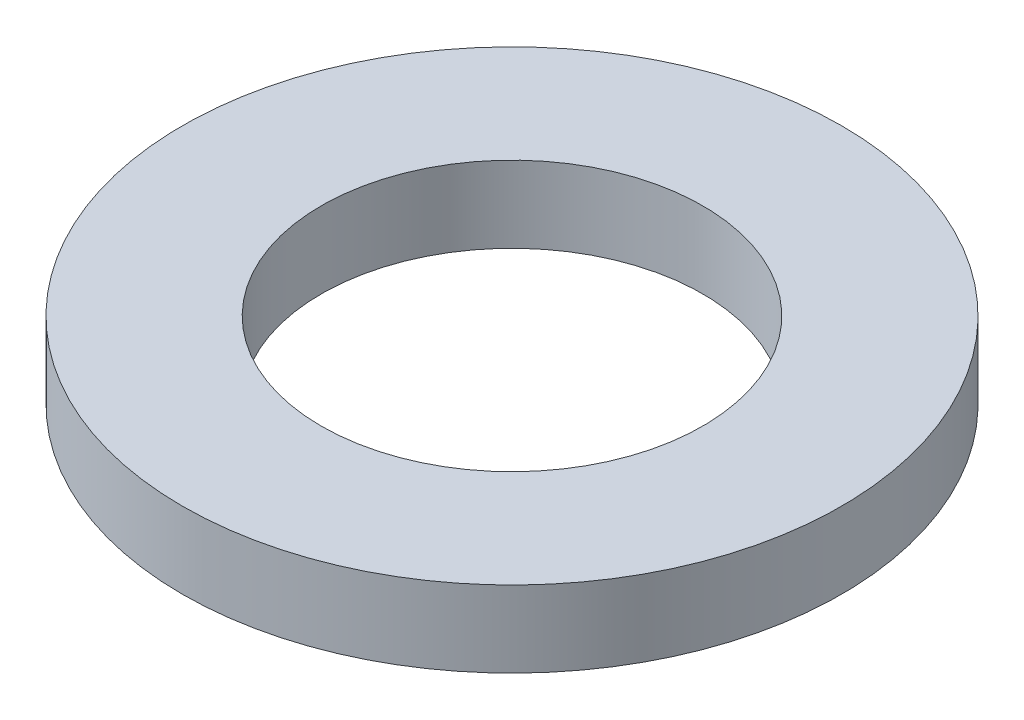
ISO-10303-21;
HEADER;
FILE_DESCRIPTION(('STEP AP214'),'2;1');
FILE_NAME('part.step','',(''),(''),'','','');
FILE_SCHEMA(('AUTOMOTIVE_DESIGN { 1 0 10303 214 1 1 1 1 }'));
ENDSEC;
DATA;
#1=APPLICATION_CONTEXT('core data for automotive mechanical design processes');
#2=APPLICATION_PROTOCOL_DEFINITION('international standard','automotive_design',2000,#1);
#3=PRODUCT_CONTEXT('',#1,'mechanical');
#4=PRODUCT('Part','Part','',(#3));
#5=PRODUCT_RELATED_PRODUCT_CATEGORY('part','',(#4));
#6=PRODUCT_DEFINITION_FORMATION('','',#4);
#7=PRODUCT_DEFINITION_CONTEXT('part definition',#1,'design');
#8=PRODUCT_DEFINITION('design','',#6,#7);
#9=PRODUCT_DEFINITION_SHAPE('','',#8);
#10=(LENGTH_UNIT() NAMED_UNIT(*) SI_UNIT(.MILLI.,.METRE.));
#11=(NAMED_UNIT(*) PLANE_ANGLE_UNIT() SI_UNIT($,.RADIAN.));
#12=(NAMED_UNIT(*) SI_UNIT($,.STERADIAN.) SOLID_ANGLE_UNIT());
#13=UNCERTAINTY_MEASURE_WITH_UNIT(LENGTH_MEASURE(1.E-05),#10,'distance_accuracy_value','');
#14=(GEOMETRIC_REPRESENTATION_CONTEXT(3) GLOBAL_UNCERTAINTY_ASSIGNED_CONTEXT((#13)) GLOBAL_UNIT_ASSIGNED_CONTEXT((#10,
#11,#12)) REPRESENTATION_CONTEXT('',''));
#15=CARTESIAN_POINT('',(0.,0.,0.));
#16=DIRECTION('',(0.,0.,1.));
#17=DIRECTION('',(1.,0.,0.));
#18=AXIS2_PLACEMENT_3D('',#15,#16,#17);
#19=CARTESIAN_POINT('',(0.,11.,0.));
#20=DIRECTION('',(0.,-1.,0.));
#21=DIRECTION('',(0.,0.,-1.));
#22=AXIS2_PLACEMENT_3D('',#19,#20,#21);
#23=CYLINDRICAL_SURFACE('',#22,47.5);
#24=CARTESIAN_POINT('',(0.,11.,0.));
#25=DIRECTION('',(0.,1.,0.));
#26=DIRECTION('',(0.,0.,1.));
#27=AXIS2_PLACEMENT_3D('',#24,#25,#26);
#28=CIRCLE('',#27,47.5);
#29=CARTESIAN_POINT('',(0.,11.,47.5));
#30=VERTEX_POINT('',#29);
#31=EDGE_CURVE('E10',#30,#30,#28,.T.);
#32=ORIENTED_EDGE('',*,*,#31,.F.);
#33=EDGE_LOOP('',(#32));
#34=FACE_BOUND('',#33,.T.);
#35=CARTESIAN_POINT('',(0.,0.,0.));
#36=DIRECTION('',(0.,1.,0.));
#37=DIRECTION('',(0.,0.,1.));
#38=AXIS2_PLACEMENT_3D('',#35,#36,#37);
#39=CIRCLE('',#38,47.5);
#40=CARTESIAN_POINT('',(0.,0.,47.5));
#41=VERTEX_POINT('',#40);
#42=EDGE_CURVE('E37',#41,#41,#39,.T.);
#43=ORIENTED_EDGE('',*,*,#42,.T.);
#44=EDGE_LOOP('',(#43));
#45=FACE_BOUND('',#44,.T.);
#46=ADVANCED_FACE('F40',(#34,#45),#23,.T.);
#47=CARTESIAN_POINT('',(0.,11.,0.));
#48=DIRECTION('',(0.,1.,0.));
#49=DIRECTION('',(0.,0.,1.));
#50=AXIS2_PLACEMENT_3D('',#47,#48,#49);
#51=PLANE('',#50);
#52=CARTESIAN_POINT('',(0.,11.,0.));
#53=DIRECTION('',(0.,1.,0.));
#54=DIRECTION('',(0.,0.,1.));
#55=AXIS2_PLACEMENT_3D('',#52,#53,#54);
#56=CIRCLE('',#55,27.5);
#57=CARTESIAN_POINT('',(0.,11.,27.5));
#58=VERTEX_POINT('',#57);
#59=EDGE_CURVE('E50',#58,#58,#56,.T.);
#60=ORIENTED_EDGE('',*,*,#59,.F.);
#61=EDGE_LOOP('',(#60));
#62=FACE_BOUND('',#61,.T.);
#63=ORIENTED_EDGE('',*,*,#31,.T.);
#64=EDGE_LOOP('',(#63));
#65=FACE_BOUND('',#64,.T.);
#66=ADVANCED_FACE('F59',(#62,#65),#51,.T.);
#67=CARTESIAN_POINT('',(0.,0.,0.));
#68=DIRECTION('',(0.,1.,0.));
#69=DIRECTION('',(0.,0.,1.));
#70=AXIS2_PLACEMENT_3D('',#67,#68,#69);
#71=PLANE('',#70);
#72=CARTESIAN_POINT('',(0.,0.,0.));
#73=DIRECTION('',(0.,1.,0.));
#74=DIRECTION('',(0.,0.,1.));
#75=AXIS2_PLACEMENT_3D('',#72,#73,#74);
#76=CIRCLE('',#75,27.5);
#77=CARTESIAN_POINT('',(0.,0.,27.5));
#78=VERTEX_POINT('',#77);
#79=EDGE_CURVE('E47',#78,#78,#76,.T.);
#80=ORIENTED_EDGE('',*,*,#79,.T.);
#81=EDGE_LOOP('',(#80));
#82=FACE_BOUND('',#81,.T.);
#83=ORIENTED_EDGE('',*,*,#42,.F.);
#84=EDGE_LOOP('',(#83));
#85=FACE_BOUND('',#84,.T.);
#86=ADVANCED_FACE('F58',(#82,#85),#71,.F.);
#87=CARTESIAN_POINT('',(0.,11.,0.));
#88=DIRECTION('',(0.,-1.,0.));
#89=DIRECTION('',(0.,0.,-1.));
#90=AXIS2_PLACEMENT_3D('',#87,#88,#89);
#91=CYLINDRICAL_SURFACE('',#90,27.5);
#92=ORIENTED_EDGE('',*,*,#59,.T.);
#93=EDGE_LOOP('',(#92));
#94=FACE_BOUND('',#93,.T.);
#95=ORIENTED_EDGE('',*,*,#79,.F.);
#96=EDGE_LOOP('',(#95));
#97=FACE_BOUND('',#96,.T.);
#98=ADVANCED_FACE('F54',(#94,#97),#91,.F.);
#99=CLOSED_SHELL('',(#46,#66,#86,#98));
#100=MANIFOLD_SOLID_BREP('B2',#99);
#101=ADVANCED_BREP_SHAPE_REPRESENTATION('',(#18,#100),#14);
#102=SHAPE_DEFINITION_REPRESENTATION(#9,#101);
ENDSEC;
END-ISO-10303-21;
